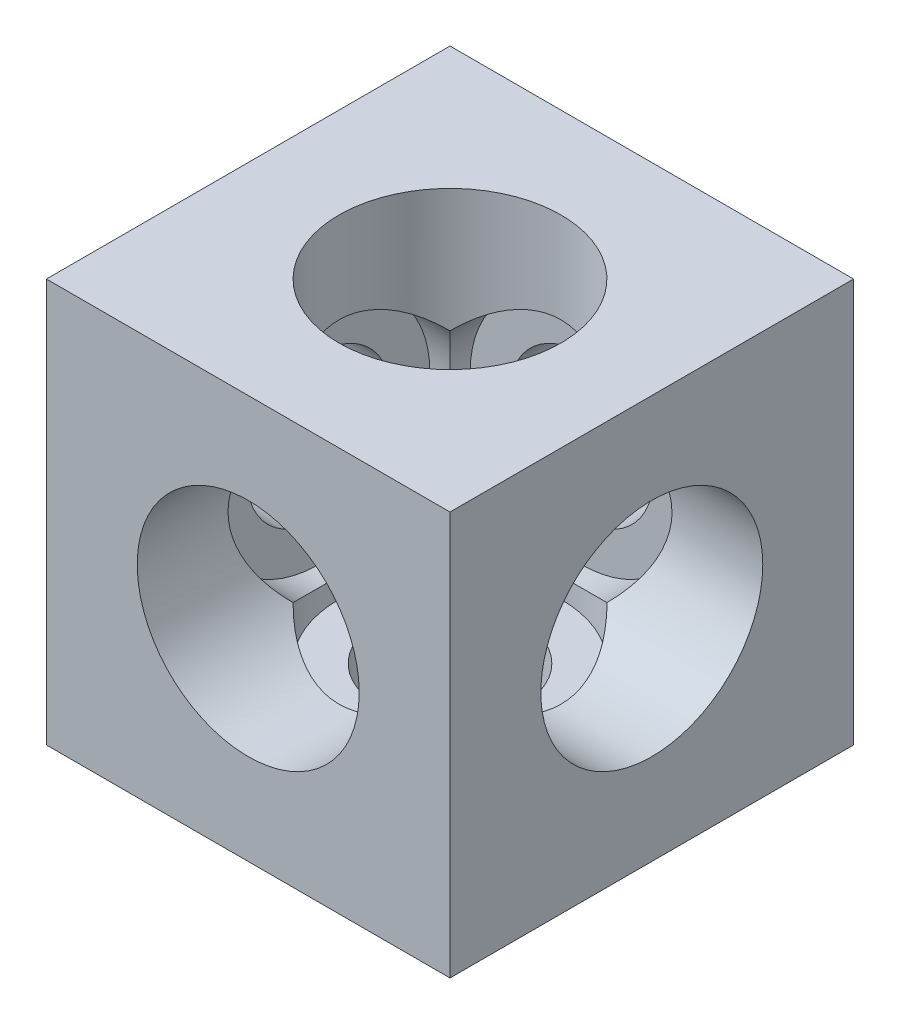
ISO-10303-21;
HEADER;
FILE_DESCRIPTION(('STEP AP214'),'2;1');
FILE_NAME('part.step','',(''),(''),'','','');
FILE_SCHEMA(('AUTOMOTIVE_DESIGN { 1 0 10303 214 1 1 1 1 }'));
ENDSEC;
DATA;
#1=APPLICATION_CONTEXT('core data for automotive mechanical design processes');
#2=APPLICATION_PROTOCOL_DEFINITION('international standard','automotive_design',2000,#1);
#3=PRODUCT_CONTEXT('',#1,'mechanical');
#4=PRODUCT('Part','Part','',(#3));
#5=PRODUCT_RELATED_PRODUCT_CATEGORY('part','',(#4));
#6=PRODUCT_DEFINITION_FORMATION('','',#4);
#7=PRODUCT_DEFINITION_CONTEXT('part definition',#1,'design');
#8=PRODUCT_DEFINITION('design','',#6,#7);
#9=PRODUCT_DEFINITION_SHAPE('','',#8);
#10=(LENGTH_UNIT() NAMED_UNIT(*) SI_UNIT(.MILLI.,.METRE.));
#11=(NAMED_UNIT(*) PLANE_ANGLE_UNIT() SI_UNIT($,.RADIAN.));
#12=(NAMED_UNIT(*) SI_UNIT($,.STERADIAN.) SOLID_ANGLE_UNIT());
#13=UNCERTAINTY_MEASURE_WITH_UNIT(LENGTH_MEASURE(1.E-05),#10,'distance_accuracy_value','');
#14=(GEOMETRIC_REPRESENTATION_CONTEXT(3) GLOBAL_UNCERTAINTY_ASSIGNED_CONTEXT((#13)) GLOBAL_UNIT_ASSIGNED_CONTEXT((#10,
#11,#12)) REPRESENTATION_CONTEXT('',''));
#15=CARTESIAN_POINT('',(0.,0.,0.));
#16=DIRECTION('',(0.,0.,1.));
#17=DIRECTION('',(1.,0.,0.));
#18=AXIS2_PLACEMENT_3D('',#15,#16,#17);
#19=CARTESIAN_POINT('',(0.,-10.,0.));
#20=DIRECTION('',(0.,1.,0.));
#21=DIRECTION('',(0.,0.,1.));
#22=AXIS2_PLACEMENT_3D('',#19,#20,#21);
#23=CYLINDRICAL_SURFACE('',#22,3.57);
#24=CARTESIAN_POINT('',(0.,-10.,0.));
#25=DIRECTION('',(0.,1.,0.));
#26=DIRECTION('',(0.,0.,1.));
#27=AXIS2_PLACEMENT_3D('',#24,#25,#26);
#28=CIRCLE('',#27,3.57);
#29=CARTESIAN_POINT('',(0.,-10.,3.57));
#30=VERTEX_POINT('',#29);
#31=EDGE_CURVE('E150',#30,#30,#28,.T.);
#32=ORIENTED_EDGE('',*,*,#31,.F.);
#33=EDGE_LOOP('',(#32));
#34=FACE_BOUND('',#33,.T.);
#35=CARTESIAN_POINT('',(0.,-6.50000000000001,0.));
#36=DIRECTION('',(0.,1.,0.));
#37=DIRECTION('',(-1.,0.,0.));
#38=AXIS2_PLACEMENT_3D('',#35,#36,#37);
#39=CIRCLE('',#38,3.57);
#40=CARTESIAN_POINT('',(-3.57,-6.50000000000001,0.));
#41=VERTEX_POINT('',#40);
#42=EDGE_CURVE('E128',#41,#41,#39,.F.);
#43=ORIENTED_EDGE('',*,*,#42,.F.);
#44=EDGE_LOOP('',(#43));
#45=FACE_BOUND('',#44,.T.);
#46=ADVANCED_FACE('F34',(#34,#45),#23,.F.);
#47=CARTESIAN_POINT('',(0.,0.,-25.556349186104));
#48=DIRECTION('',(0.,0.,1.));
#49=DIRECTION('',(1.,0.,0.));
#50=AXIS2_PLACEMENT_3D('',#47,#48,#49);
#51=CYLINDRICAL_SURFACE('',#50,5.5);
#52=CARTESIAN_POINT('',(0.,0.,10.));
#53=DIRECTION('',(0.,0.,1.));
#54=DIRECTION('',(1.,0.,0.));
#55=AXIS2_PLACEMENT_3D('',#52,#53,#54);
#56=CIRCLE('',#55,5.5);
#57=CARTESIAN_POINT('',(5.5,0.,10.));
#58=VERTEX_POINT('',#57);
#59=EDGE_CURVE('E162',#58,#58,#56,.T.);
#60=ORIENTED_EDGE('',*,*,#59,.T.);
#61=EDGE_LOOP('',(#60));
#62=FACE_BOUND('',#61,.T.);
#63=CARTESIAN_POINT('',(0.,0.,0.));
#64=DIRECTION('',(-0.707106781186547,0.,0.707106781186547));
#65=DIRECTION('',(0.707106781186547,0.,0.707106781186547));
#66=AXIS2_PLACEMENT_3D('',#63,#64,#65);
#67=ELLIPSE('',#66,7.77817459305202,5.5);
#68=CARTESIAN_POINT('',(3.88908729652601,3.88908729652601,3.88908729652601));
#69=VERTEX_POINT('',#68);
#70=CARTESIAN_POINT('',(3.88908729652601,-3.88908729652601,3.88908729652601));
#71=VERTEX_POINT('',#70);
#72=EDGE_CURVE('E108',#69,#71,#67,.F.);
#73=ORIENTED_EDGE('',*,*,#72,.T.);
#74=CARTESIAN_POINT('',(0.,0.,0.));
#75=DIRECTION('',(0.,0.707106781186547,0.707106781186547));
#76=DIRECTION('',(0.,-0.707106781186547,0.707106781186547));
#77=AXIS2_PLACEMENT_3D('',#74,#75,#76);
#78=ELLIPSE('',#77,7.77817459305202,5.5);
#79=CARTESIAN_POINT('',(-3.88908729652601,-3.88908729652601,3.88908729652601));
#80=VERTEX_POINT('',#79);
#81=EDGE_CURVE('E49',#71,#80,#78,.F.);
#82=ORIENTED_EDGE('',*,*,#81,.T.);
#83=CARTESIAN_POINT('',(0.,0.,0.));
#84=DIRECTION('',(0.707106781186547,0.,0.707106781186547));
#85=DIRECTION('',(-0.707106781186547,0.,0.707106781186547));
#86=AXIS2_PLACEMENT_3D('',#83,#84,#85);
#87=ELLIPSE('',#86,7.77817459305202,5.5);
#88=CARTESIAN_POINT('',(-3.88908729652601,3.88908729652601,3.88908729652601));
#89=VERTEX_POINT('',#88);
#90=EDGE_CURVE('E103',#80,#89,#87,.F.);
#91=ORIENTED_EDGE('',*,*,#90,.T.);
#92=CARTESIAN_POINT('',(0.,0.,0.));
#93=DIRECTION('',(0.,-0.707106781186547,0.707106781186547));
#94=DIRECTION('',(0.,0.707106781186547,0.707106781186547));
#95=AXIS2_PLACEMENT_3D('',#92,#93,#94);
#96=ELLIPSE('',#95,7.77817459305202,5.5);
#97=EDGE_CURVE('E97',#89,#69,#96,.F.);
#98=ORIENTED_EDGE('',*,*,#97,.T.);
#99=EDGE_LOOP('',(#73,#82,#91,#98));
#100=FACE_BOUND('',#99,.T.);
#101=ADVANCED_FACE('F107',(#62,#100),#51,.F.);
#102=CARTESIAN_POINT('',(-10.,0.,0.));
#103=DIRECTION('',(1.,0.,0.));
#104=DIRECTION('',(0.,0.,-1.));
#105=AXIS2_PLACEMENT_3D('',#102,#103,#104);
#106=CYLINDRICAL_SURFACE('',#105,3.57);
#107=CARTESIAN_POINT('',(-10.,0.,0.));
#108=DIRECTION('',(1.,0.,0.));
#109=DIRECTION('',(0.,0.,-1.));
#110=AXIS2_PLACEMENT_3D('',#107,#108,#109);
#111=CIRCLE('',#110,3.57);
#112=CARTESIAN_POINT('',(-10.,0.,-3.57));
#113=VERTEX_POINT('',#112);
#114=EDGE_CURVE('E159',#113,#113,#111,.T.);
#115=ORIENTED_EDGE('',*,*,#114,.F.);
#116=EDGE_LOOP('',(#115));
#117=FACE_BOUND('',#116,.T.);
#118=CARTESIAN_POINT('',(-6.5,0.,0.));
#119=DIRECTION('',(1.,0.,0.));
#120=DIRECTION('',(0.,0.,-1.));
#121=AXIS2_PLACEMENT_3D('',#118,#119,#120);
#122=CIRCLE('',#121,3.57);
#123=CARTESIAN_POINT('',(-6.5,0.,-3.57));
#124=VERTEX_POINT('',#123);
#125=EDGE_CURVE('E123',#124,#124,#122,.F.);
#126=ORIENTED_EDGE('',*,*,#125,.F.);
#127=EDGE_LOOP('',(#126));
#128=FACE_BOUND('',#127,.T.);
#129=ADVANCED_FACE('F223',(#117,#128),#106,.F.);
#130=CARTESIAN_POINT('',(9.99999999999999,-10.,10.));
#131=DIRECTION('',(-1.,0.,0.));
#132=DIRECTION('',(0.,0.,1.));
#133=AXIS2_PLACEMENT_3D('',#130,#131,#132);
#134=PLANE('',#133);
#135=CARTESIAN_POINT('',(9.99999999999999,0.,0.));
#136=DIRECTION('',(1.,0.,0.));
#137=DIRECTION('',(0.,0.,-1.));
#138=AXIS2_PLACEMENT_3D('',#135,#136,#137);
#139=CIRCLE('',#138,5.5);
#140=CARTESIAN_POINT('',(9.99999999999999,0.,-5.5));
#141=VERTEX_POINT('',#140);
#142=EDGE_CURVE('E153',#141,#141,#139,.T.);
#143=ORIENTED_EDGE('',*,*,#142,.F.);
#144=EDGE_LOOP('',(#143));
#145=FACE_BOUND('',#144,.T.);
#146=DIRECTION('',(0.,1.,0.));
#147=VECTOR('',#146,1.);
#148=CARTESIAN_POINT('',(9.99999999999999,-10.,-10.));
#149=LINE('',#148,#147);
#150=CARTESIAN_POINT('',(9.99999999999999,-10.,-10.));
#151=VERTEX_POINT('',#150);
#152=CARTESIAN_POINT('',(9.99999999999999,9.99999999999999,-10.));
#153=VERTEX_POINT('',#152);
#154=EDGE_CURVE('E172',#151,#153,#149,.T.);
#155=ORIENTED_EDGE('',*,*,#154,.T.);
#156=DIRECTION('',(0.,0.,-1.));
#157=VECTOR('',#156,1.);
#158=CARTESIAN_POINT('',(9.99999999999999,9.99999999999999,10.));
#159=LINE('',#158,#157);
#160=CARTESIAN_POINT('',(9.99999999999999,9.99999999999999,10.));
#161=VERTEX_POINT('',#160);
#162=EDGE_CURVE('E114',#161,#153,#159,.T.);
#163=ORIENTED_EDGE('',*,*,#162,.F.);
#164=DIRECTION('',(0.,1.,0.));
#165=VECTOR('',#164,1.);
#166=CARTESIAN_POINT('',(9.99999999999999,-10.,10.));
#167=LINE('',#166,#165);
#168=CARTESIAN_POINT('',(9.99999999999999,-10.,10.));
#169=VERTEX_POINT('',#168);
#170=EDGE_CURVE('E173',#169,#161,#167,.T.);
#171=ORIENTED_EDGE('',*,*,#170,.F.);
#172=DIRECTION('',(0.,0.,-1.));
#173=VECTOR('',#172,1.);
#174=CARTESIAN_POINT('',(9.99999999999999,-10.,10.));
#175=LINE('',#174,#173);
#176=EDGE_CURVE('E183',#169,#151,#175,.T.);
#177=ORIENTED_EDGE('',*,*,#176,.T.);
#178=EDGE_LOOP('',(#155,#163,#171,#177));
#179=FACE_BOUND('',#178,.T.);
#180=ADVANCED_FACE('F36',(#145,#179),#134,.F.);
#181=CARTESIAN_POINT('',(-10.,9.99999999999999,10.));
#182=DIRECTION('',(0.,-1.,0.));
#183=DIRECTION('',(0.,0.,-1.));
#184=AXIS2_PLACEMENT_3D('',#181,#182,#183);
#185=PLANE('',#184);
#186=CARTESIAN_POINT('',(0.,9.99999999999999,0.));
#187=DIRECTION('',(0.,1.,0.));
#188=DIRECTION('',(0.,0.,1.));
#189=AXIS2_PLACEMENT_3D('',#186,#187,#188);
#190=CIRCLE('',#189,5.5);
#191=CARTESIAN_POINT('',(0.,9.99999999999999,5.5));
#192=VERTEX_POINT('',#191);
#193=EDGE_CURVE('E135',#192,#192,#190,.T.);
#194=ORIENTED_EDGE('',*,*,#193,.F.);
#195=EDGE_LOOP('',(#194));
#196=FACE_BOUND('',#195,.T.);
#197=DIRECTION('',(-1.,0.,0.));
#198=VECTOR('',#197,1.);
#199=CARTESIAN_POINT('',(-10.,9.99999999999999,-10.));
#200=LINE('',#199,#198);
#201=CARTESIAN_POINT('',(-10.,9.99999999999999,-10.));
#202=VERTEX_POINT('',#201);
#203=EDGE_CURVE('E186',#153,#202,#200,.T.);
#204=ORIENTED_EDGE('',*,*,#203,.T.);
#205=DIRECTION('',(0.,0.,-1.));
#206=VECTOR('',#205,1.);
#207=CARTESIAN_POINT('',(-10.,9.99999999999999,10.));
#208=LINE('',#207,#206);
#209=CARTESIAN_POINT('',(-10.,9.99999999999999,10.));
#210=VERTEX_POINT('',#209);
#211=EDGE_CURVE('E120',#210,#202,#208,.T.);
#212=ORIENTED_EDGE('',*,*,#211,.F.);
#213=DIRECTION('',(-1.,0.,0.));
#214=VECTOR('',#213,1.);
#215=CARTESIAN_POINT('',(-10.,9.99999999999999,10.));
#216=LINE('',#215,#214);
#217=EDGE_CURVE('E176',#161,#210,#216,.T.);
#218=ORIENTED_EDGE('',*,*,#217,.F.);
#219=ORIENTED_EDGE('',*,*,#162,.T.);
#220=EDGE_LOOP('',(#204,#212,#218,#219));
#221=FACE_BOUND('',#220,.T.);
#222=ADVANCED_FACE('F243',(#196,#221),#185,.F.);
#223=CARTESIAN_POINT('',(-10.,-10.,10.));
#224=DIRECTION('',(1.,0.,0.));
#225=DIRECTION('',(0.,0.,-1.));
#226=AXIS2_PLACEMENT_3D('',#223,#224,#225);
#227=PLANE('',#226);
#228=ORIENTED_EDGE('',*,*,#114,.T.);
#229=EDGE_LOOP('',(#228));
#230=FACE_BOUND('',#229,.T.);
#231=DIRECTION('',(0.,-1.,0.));
#232=VECTOR('',#231,1.);
#233=CARTESIAN_POINT('',(-10.,-10.,-10.));
#234=LINE('',#233,#232);
#235=CARTESIAN_POINT('',(-10.,-10.,-10.));
#236=VERTEX_POINT('',#235);
#237=EDGE_CURVE('E188',#202,#236,#234,.T.);
#238=ORIENTED_EDGE('',*,*,#237,.T.);
#239=DIRECTION('',(0.,0.,-1.));
#240=VECTOR('',#239,1.);
#241=CARTESIAN_POINT('',(-10.,-10.,10.));
#242=LINE('',#241,#240);
#243=CARTESIAN_POINT('',(-10.,-10.,10.));
#244=VERTEX_POINT('',#243);
#245=EDGE_CURVE('E193',#244,#236,#242,.T.);
#246=ORIENTED_EDGE('',*,*,#245,.F.);
#247=DIRECTION('',(0.,-1.,0.));
#248=VECTOR('',#247,1.);
#249=CARTESIAN_POINT('',(-10.,-10.,10.));
#250=LINE('',#249,#248);
#251=EDGE_CURVE('E179',#210,#244,#250,.T.);
#252=ORIENTED_EDGE('',*,*,#251,.F.);
#253=ORIENTED_EDGE('',*,*,#211,.T.);
#254=EDGE_LOOP('',(#238,#246,#252,#253));
#255=FACE_BOUND('',#254,.T.);
#256=ADVANCED_FACE('F251',(#230,#255),#227,.F.);
#257=CARTESIAN_POINT('',(-10.,-10.,10.));
#258=DIRECTION('',(0.,1.,0.));
#259=DIRECTION('',(-1.,0.,0.));
#260=AXIS2_PLACEMENT_3D('',#257,#258,#259);
#261=PLANE('',#260);
#262=ORIENTED_EDGE('',*,*,#31,.T.);
#263=EDGE_LOOP('',(#262));
#264=FACE_BOUND('',#263,.T.);
#265=DIRECTION('',(1.,0.,0.));
#266=VECTOR('',#265,1.);
#267=CARTESIAN_POINT('',(-10.,-10.,-10.));
#268=LINE('',#267,#266);
#269=EDGE_CURVE('E177',#236,#151,#268,.T.);
#270=ORIENTED_EDGE('',*,*,#269,.T.);
#271=ORIENTED_EDGE('',*,*,#176,.F.);
#272=DIRECTION('',(1.,0.,0.));
#273=VECTOR('',#272,1.);
#274=CARTESIAN_POINT('',(-10.,-10.,10.));
#275=LINE('',#274,#273);
#276=EDGE_CURVE('E181',#244,#169,#275,.T.);
#277=ORIENTED_EDGE('',*,*,#276,.F.);
#278=ORIENTED_EDGE('',*,*,#245,.T.);
#279=EDGE_LOOP('',(#270,#271,#277,#278));
#280=FACE_BOUND('',#279,.T.);
#281=ADVANCED_FACE('F254',(#264,#280),#261,.F.);
#282=CARTESIAN_POINT('',(9.99999999999999,9.99999999999999,10.));
#283=DIRECTION('',(0.,0.,-1.));
#284=DIRECTION('',(-1.,0.,0.));
#285=AXIS2_PLACEMENT_3D('',#282,#283,#284);
#286=PLANE('',#285);
#287=ORIENTED_EDGE('',*,*,#59,.F.);
#288=EDGE_LOOP('',(#287));
#289=FACE_BOUND('',#288,.T.);
#290=ORIENTED_EDGE('',*,*,#170,.T.);
#291=ORIENTED_EDGE('',*,*,#217,.T.);
#292=ORIENTED_EDGE('',*,*,#251,.T.);
#293=ORIENTED_EDGE('',*,*,#276,.T.);
#294=EDGE_LOOP('',(#290,#291,#292,#293));
#295=FACE_BOUND('',#294,.T.);
#296=ADVANCED_FACE('F270',(#289,#295),#286,.F.);
#297=CARTESIAN_POINT('',(9.99999999999999,9.99999999999999,-10.));
#298=DIRECTION('',(0.,0.,-1.));
#299=DIRECTION('',(-1.,0.,0.));
#300=AXIS2_PLACEMENT_3D('',#297,#298,#299);
#301=PLANE('',#300);
#302=CARTESIAN_POINT('',(0.,0.,-10.));
#303=DIRECTION('',(0.,0.,1.));
#304=DIRECTION('',(1.,0.,0.));
#305=AXIS2_PLACEMENT_3D('',#302,#303,#304);
#306=CIRCLE('',#305,3.57);
#307=CARTESIAN_POINT('',(3.57,0.,-10.));
#308=VERTEX_POINT('',#307);
#309=EDGE_CURVE('E169',#308,#308,#306,.T.);
#310=ORIENTED_EDGE('',*,*,#309,.T.);
#311=EDGE_LOOP('',(#310));
#312=FACE_BOUND('',#311,.T.);
#313=ORIENTED_EDGE('',*,*,#154,.F.);
#314=ORIENTED_EDGE('',*,*,#269,.F.);
#315=ORIENTED_EDGE('',*,*,#237,.F.);
#316=ORIENTED_EDGE('',*,*,#203,.F.);
#317=EDGE_LOOP('',(#313,#314,#315,#316));
#318=FACE_BOUND('',#317,.T.);
#319=ADVANCED_FACE('F215',(#312,#318),#301,.T.);
#320=CARTESIAN_POINT('',(0.,0.,-10.));
#321=DIRECTION('',(0.,0.,1.));
#322=DIRECTION('',(1.,0.,0.));
#323=AXIS2_PLACEMENT_3D('',#320,#321,#322);
#324=CYLINDRICAL_SURFACE('',#323,3.57);
#325=CARTESIAN_POINT('',(0.,0.,-6.5));
#326=DIRECTION('',(0.,0.,-1.));
#327=DIRECTION('',(-1.,0.,0.));
#328=AXIS2_PLACEMENT_3D('',#325,#326,#327);
#329=CIRCLE('',#328,3.57);
#330=CARTESIAN_POINT('',(-3.57,0.,-6.5));
#331=VERTEX_POINT('',#330);
#332=EDGE_CURVE('E168',#331,#331,#329,.F.);
#333=ORIENTED_EDGE('',*,*,#332,.T.);
#334=EDGE_LOOP('',(#333));
#335=FACE_BOUND('',#334,.T.);
#336=ORIENTED_EDGE('',*,*,#309,.F.);
#337=EDGE_LOOP('',(#336));
#338=FACE_BOUND('',#337,.T.);
#339=ADVANCED_FACE('F200',(#335,#338),#324,.F.);
#340=CARTESIAN_POINT('',(9.99999999999999,9.99999999999999,-6.5));
#341=DIRECTION('',(0.,0.,-1.));
#342=DIRECTION('',(-1.,0.,0.));
#343=AXIS2_PLACEMENT_3D('',#340,#341,#342);
#344=PLANE('',#343);
#345=CARTESIAN_POINT('',(0.,0.,-6.5));
#346=DIRECTION('',(0.,0.,-1.));
#347=DIRECTION('',(-1.,0.,0.));
#348=AXIS2_PLACEMENT_3D('',#345,#346,#347);
#349=CIRCLE('',#348,5.5);
#350=CARTESIAN_POINT('',(-5.5,0.,-6.5));
#351=VERTEX_POINT('',#350);
#352=EDGE_CURVE('E165',#351,#351,#349,.F.);
#353=ORIENTED_EDGE('',*,*,#352,.T.);
#354=EDGE_LOOP('',(#353));
#355=FACE_BOUND('',#354,.T.);
#356=ORIENTED_EDGE('',*,*,#332,.F.);
#357=EDGE_LOOP('',(#356));
#358=FACE_BOUND('',#357,.T.);
#359=ADVANCED_FACE('F203',(#355,#358),#344,.F.);
#360=CARTESIAN_POINT('',(0.,0.,0.));
#361=DIRECTION('',(0.707106781186547,0.,0.707106781186547));
#362=DIRECTION('',(-0.707106781186547,0.,0.707106781186547));
#363=AXIS2_PLACEMENT_3D('',#360,#361,#362);
#364=ELLIPSE('',#363,7.77817459305202,5.5);
#365=CARTESIAN_POINT('',(3.88908729652601,-3.88908729652601,-3.88908729652601));
#366=VERTEX_POINT('',#365);
#367=CARTESIAN_POINT('',(3.88908729652601,3.88908729652601,-3.88908729652601));
#368=VERTEX_POINT('',#367);
#369=EDGE_CURVE('E117',#366,#368,#364,.T.);
#370=ORIENTED_EDGE('',*,*,#369,.T.);
#371=CARTESIAN_POINT('',(0.,0.,0.));
#372=DIRECTION('',(0.,0.707106781186547,0.707106781186547));
#373=DIRECTION('',(0.,-0.707106781186547,0.707106781186547));
#374=AXIS2_PLACEMENT_3D('',#371,#372,#373);
#375=ELLIPSE('',#374,7.77817459305202,5.5);
#376=CARTESIAN_POINT('',(-3.88908729652601,3.88908729652601,-3.88908729652601));
#377=VERTEX_POINT('',#376);
#378=EDGE_CURVE('E56',#368,#377,#375,.T.);
#379=ORIENTED_EDGE('',*,*,#378,.T.);
#380=CARTESIAN_POINT('',(0.,0.,0.));
#381=DIRECTION('',(-0.707106781186547,0.,0.707106781186547));
#382=DIRECTION('',(0.707106781186547,0.,0.707106781186547));
#383=AXIS2_PLACEMENT_3D('',#380,#381,#382);
#384=ELLIPSE('',#383,7.77817459305202,5.5);
#385=CARTESIAN_POINT('',(-3.88908729652601,-3.88908729652601,-3.88908729652601));
#386=VERTEX_POINT('',#385);
#387=EDGE_CURVE('E113',#377,#386,#384,.T.);
#388=ORIENTED_EDGE('',*,*,#387,.T.);
#389=CARTESIAN_POINT('',(0.,0.,0.));
#390=DIRECTION('',(0.,-0.707106781186547,0.707106781186547));
#391=DIRECTION('',(0.,0.707106781186547,0.707106781186547));
#392=AXIS2_PLACEMENT_3D('',#389,#390,#391);
#393=ELLIPSE('',#392,7.77817459305202,5.5);
#394=EDGE_CURVE('E143',#386,#366,#393,.T.);
#395=ORIENTED_EDGE('',*,*,#394,.T.);
#396=EDGE_LOOP('',(#370,#379,#388,#395));
#397=FACE_BOUND('',#396,.T.);
#398=ORIENTED_EDGE('',*,*,#352,.F.);
#399=EDGE_LOOP('',(#398));
#400=FACE_BOUND('',#399,.T.);
#401=ADVANCED_FACE('F205',(#397,#400),#51,.F.);
#402=CARTESIAN_POINT('',(-6.5,-10.,10.));
#403=DIRECTION('',(1.,0.,0.));
#404=DIRECTION('',(0.,0.,-1.));
#405=AXIS2_PLACEMENT_3D('',#402,#403,#404);
#406=PLANE('',#405);
#407=CARTESIAN_POINT('',(-6.5,0.,0.));
#408=DIRECTION('',(1.,0.,0.));
#409=DIRECTION('',(0.,0.,-1.));
#410=AXIS2_PLACEMENT_3D('',#407,#408,#409);
#411=CIRCLE('',#410,5.5);
#412=CARTESIAN_POINT('',(-6.5,0.,-5.5));
#413=VERTEX_POINT('',#412);
#414=EDGE_CURVE('E156',#413,#413,#411,.F.);
#415=ORIENTED_EDGE('',*,*,#414,.F.);
#416=EDGE_LOOP('',(#415));
#417=FACE_BOUND('',#416,.T.);
#418=ORIENTED_EDGE('',*,*,#125,.T.);
#419=EDGE_LOOP('',(#418));
#420=FACE_BOUND('',#419,.T.);
#421=ADVANCED_FACE('F212',(#417,#420),#406,.T.);
#422=CARTESIAN_POINT('',(-25.556349186104,0.,0.));
#423=DIRECTION('',(1.,0.,0.));
#424=DIRECTION('',(0.,0.,-1.));
#425=AXIS2_PLACEMENT_3D('',#422,#423,#424);
#426=CYLINDRICAL_SURFACE('',#425,5.5);
#427=ORIENTED_EDGE('',*,*,#414,.T.);
#428=EDGE_LOOP('',(#427));
#429=FACE_BOUND('',#428,.T.);
#430=ORIENTED_EDGE('',*,*,#387,.F.);
#431=CARTESIAN_POINT('',(0.,0.,0.));
#432=DIRECTION('',(0.707106781186547,0.707106781186547,0.));
#433=DIRECTION('',(0.707106781186547,-0.707106781186547,0.));
#434=AXIS2_PLACEMENT_3D('',#431,#432,#433);
#435=ELLIPSE('',#434,7.77817459305202,5.5);
#436=EDGE_CURVE('E110',#377,#89,#435,.T.);
#437=ORIENTED_EDGE('',*,*,#436,.T.);
#438=ORIENTED_EDGE('',*,*,#90,.F.);
#439=CARTESIAN_POINT('',(0.,0.,0.));
#440=DIRECTION('',(0.707106781186547,-0.707106781186547,0.));
#441=DIRECTION('',(0.707106781186547,0.707106781186547,0.));
#442=AXIS2_PLACEMENT_3D('',#439,#440,#441);
#443=ELLIPSE('',#442,7.77817459305202,5.5);
#444=EDGE_CURVE('E147',#80,#386,#443,.T.);
#445=ORIENTED_EDGE('',*,*,#444,.T.);
#446=EDGE_LOOP('',(#430,#437,#438,#445));
#447=FACE_BOUND('',#446,.T.);
#448=ADVANCED_FACE('F233',(#429,#447),#426,.F.);
#449=ORIENTED_EDGE('',*,*,#142,.T.);
#450=EDGE_LOOP('',(#449));
#451=FACE_BOUND('',#450,.T.);
#452=ORIENTED_EDGE('',*,*,#369,.F.);
#453=CARTESIAN_POINT('',(0.,0.,0.));
#454=DIRECTION('',(0.707106781186547,0.707106781186547,0.));
#455=DIRECTION('',(0.707106781186547,-0.707106781186547,0.));
#456=AXIS2_PLACEMENT_3D('',#453,#454,#455);
#457=ELLIPSE('',#456,7.77817459305202,5.5);
#458=EDGE_CURVE('E12',#366,#71,#457,.F.);
#459=ORIENTED_EDGE('',*,*,#458,.T.);
#460=ORIENTED_EDGE('',*,*,#72,.F.);
#461=CARTESIAN_POINT('',(0.,0.,0.));
#462=DIRECTION('',(0.707106781186547,-0.707106781186547,0.));
#463=DIRECTION('',(0.707106781186547,0.707106781186547,0.));
#464=AXIS2_PLACEMENT_3D('',#461,#462,#463);
#465=ELLIPSE('',#464,7.77817459305202,5.5);
#466=EDGE_CURVE('E42',#69,#368,#465,.F.);
#467=ORIENTED_EDGE('',*,*,#466,.T.);
#468=EDGE_LOOP('',(#452,#459,#460,#467));
#469=FACE_BOUND('',#468,.T.);
#470=ADVANCED_FACE('F112',(#451,#469),#426,.F.);
#471=CARTESIAN_POINT('',(-10.,-6.5,10.));
#472=DIRECTION('',(0.,1.,0.));
#473=DIRECTION('',(-1.,0.,0.));
#474=AXIS2_PLACEMENT_3D('',#471,#472,#473);
#475=PLANE('',#474);
#476=CARTESIAN_POINT('',(0.,-6.50000000000001,0.));
#477=DIRECTION('',(0.,1.,0.));
#478=DIRECTION('',(-1.,0.,0.));
#479=AXIS2_PLACEMENT_3D('',#476,#477,#478);
#480=CIRCLE('',#479,5.5);
#481=CARTESIAN_POINT('',(-5.5,-6.5,0.));
#482=VERTEX_POINT('',#481);
#483=EDGE_CURVE('E130',#482,#482,#480,.F.);
#484=ORIENTED_EDGE('',*,*,#483,.F.);
#485=EDGE_LOOP('',(#484));
#486=FACE_BOUND('',#485,.T.);
#487=ORIENTED_EDGE('',*,*,#42,.T.);
#488=EDGE_LOOP('',(#487));
#489=FACE_BOUND('',#488,.T.);
#490=ADVANCED_FACE('F365',(#486,#489),#475,.T.);
#491=CARTESIAN_POINT('',(0.,-25.5563491861041,0.));
#492=DIRECTION('',(0.,1.,0.));
#493=DIRECTION('',(0.,0.,1.));
#494=AXIS2_PLACEMENT_3D('',#491,#492,#493);
#495=CYLINDRICAL_SURFACE('',#494,5.5);
#496=ORIENTED_EDGE('',*,*,#483,.T.);
#497=EDGE_LOOP('',(#496));
#498=FACE_BOUND('',#497,.T.);
#499=ORIENTED_EDGE('',*,*,#81,.F.);
#500=ORIENTED_EDGE('',*,*,#458,.F.);
#501=ORIENTED_EDGE('',*,*,#394,.F.);
#502=ORIENTED_EDGE('',*,*,#444,.F.);
#503=EDGE_LOOP('',(#499,#500,#501,#502));
#504=FACE_BOUND('',#503,.T.);
#505=ADVANCED_FACE('F229',(#498,#504),#495,.F.);
#506=ORIENTED_EDGE('',*,*,#193,.T.);
#507=EDGE_LOOP('',(#506));
#508=FACE_BOUND('',#507,.T.);
#509=ORIENTED_EDGE('',*,*,#378,.F.);
#510=ORIENTED_EDGE('',*,*,#466,.F.);
#511=ORIENTED_EDGE('',*,*,#97,.F.);
#512=ORIENTED_EDGE('',*,*,#436,.F.);
#513=EDGE_LOOP('',(#509,#510,#511,#512));
#514=FACE_BOUND('',#513,.T.);
#515=ADVANCED_FACE('F96',(#508,#514),#495,.F.);
#516=CLOSED_SHELL('',(#46,#101,#129,#180,#222,#256,#281,#296,#319,#339,#359,#401,#421,#448,#470,
#490,#505,#515));
#517=MANIFOLD_SOLID_BREP('B2',#516);
#518=ADVANCED_BREP_SHAPE_REPRESENTATION('',(#18,#517),#14);
#519=SHAPE_DEFINITION_REPRESENTATION(#9,#518);
ENDSEC;
END-ISO-10303-21;
